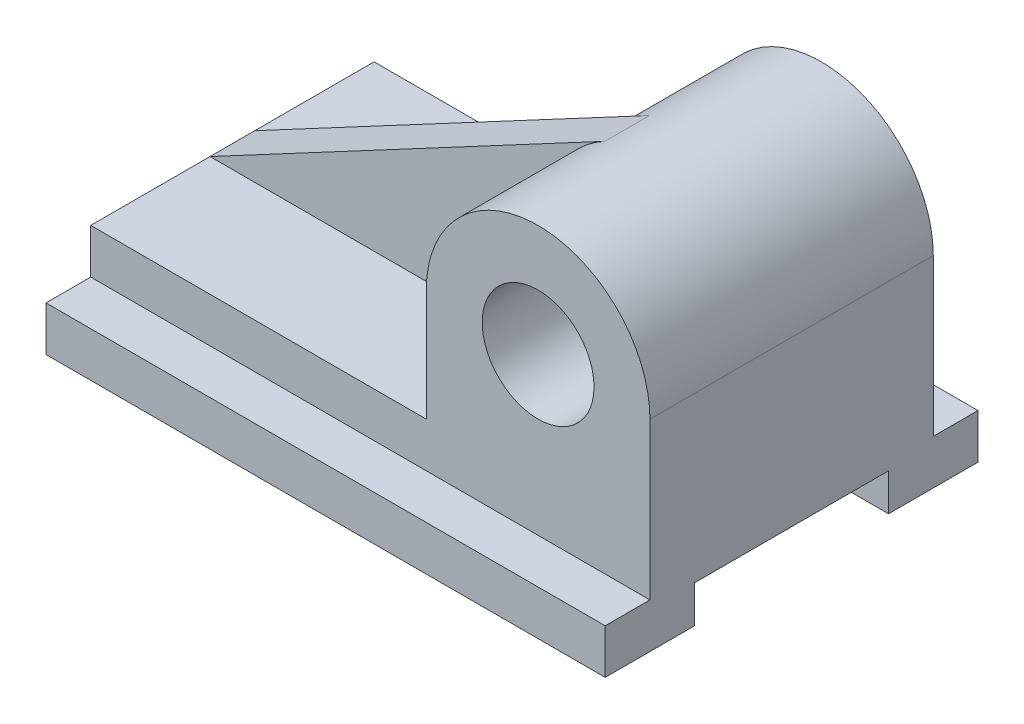
ISO-10303-21;
HEADER;
FILE_DESCRIPTION(('STEP AP214'),'2;1');
FILE_NAME('part.step','',(''),(''),'','','');
FILE_SCHEMA(('AUTOMOTIVE_DESIGN { 1 0 10303 214 1 1 1 1 }'));
ENDSEC;
DATA;
#1=APPLICATION_CONTEXT('core data for automotive mechanical design processes');
#2=APPLICATION_PROTOCOL_DEFINITION('international standard','automotive_design',2000,#1);
#3=PRODUCT_CONTEXT('',#1,'mechanical');
#4=PRODUCT('Part','Part','',(#3));
#5=PRODUCT_RELATED_PRODUCT_CATEGORY('part','',(#4));
#6=PRODUCT_DEFINITION_FORMATION('','',#4);
#7=PRODUCT_DEFINITION_CONTEXT('part definition',#1,'design');
#8=PRODUCT_DEFINITION('design','',#6,#7);
#9=PRODUCT_DEFINITION_SHAPE('','',#8);
#10=(LENGTH_UNIT() NAMED_UNIT(*) SI_UNIT(.MILLI.,.METRE.));
#11=(NAMED_UNIT(*) PLANE_ANGLE_UNIT() SI_UNIT($,.RADIAN.));
#12=(NAMED_UNIT(*) SI_UNIT($,.STERADIAN.) SOLID_ANGLE_UNIT());
#13=UNCERTAINTY_MEASURE_WITH_UNIT(LENGTH_MEASURE(1.E-05),#10,'distance_accuracy_value','');
#14=(GEOMETRIC_REPRESENTATION_CONTEXT(3) GLOBAL_UNCERTAINTY_ASSIGNED_CONTEXT((#13)) GLOBAL_UNIT_ASSIGNED_CONTEXT((#10,
#11,#12)) REPRESENTATION_CONTEXT('',''));
#15=CARTESIAN_POINT('',(0.,0.,0.));
#16=DIRECTION('',(0.,0.,1.));
#17=DIRECTION('',(1.,0.,0.));
#18=AXIS2_PLACEMENT_3D('',#15,#16,#17);
#19=CARTESIAN_POINT('',(0.,0.,76.));
#20=DIRECTION('',(0.,0.,-1.));
#21=DIRECTION('',(-1.,0.,0.));
#22=AXIS2_PLACEMENT_3D('',#19,#20,#21);
#23=CYLINDRICAL_SURFACE('',#22,30.);
#24=DIRECTION('',(0.,0.,-1.));
#25=VECTOR('',#24,1.);
#26=CARTESIAN_POINT('',(-14.1176470588235,26.4705882352941,44.));
#27=LINE('',#26,#25);
#28=CARTESIAN_POINT('',(-14.1176470588235,26.4705882352941,44.));
#29=VERTEX_POINT('',#28);
#30=CARTESIAN_POINT('',(-14.1176470588235,26.4705882352941,32.));
#31=VERTEX_POINT('',#30);
#32=EDGE_CURVE('E60',#29,#31,#27,.T.);
#33=ORIENTED_EDGE('',*,*,#32,.F.);
#34=CARTESIAN_POINT('',(0.,0.,44.));
#35=DIRECTION('',(0.,0.,1.));
#36=DIRECTION('',(1.,0.,0.));
#37=AXIS2_PLACEMENT_3D('',#34,#35,#36);
#38=CIRCLE('',#37,30.);
#39=CARTESIAN_POINT('',(-30.,0.,44.));
#40=VERTEX_POINT('',#39);
#41=EDGE_CURVE('E356',#29,#40,#38,.T.);
#42=ORIENTED_EDGE('',*,*,#41,.T.);
#43=DIRECTION('',(0.,0.,-1.));
#44=VECTOR('',#43,1.);
#45=CARTESIAN_POINT('',(-30.,0.,76.));
#46=LINE('',#45,#44);
#47=CARTESIAN_POINT('',(-30.,0.,76.));
#48=VERTEX_POINT('',#47);
#49=EDGE_CURVE('E44',#48,#40,#46,.T.);
#50=ORIENTED_EDGE('',*,*,#49,.F.);
#51=CARTESIAN_POINT('',(0.,0.,76.));
#52=DIRECTION('',(0.,0.,1.));
#53=DIRECTION('',(1.,0.,0.));
#54=AXIS2_PLACEMENT_3D('',#51,#52,#53);
#55=CIRCLE('',#54,30.);
#56=CARTESIAN_POINT('',(30.,0.,76.));
#57=VERTEX_POINT('',#56);
#58=EDGE_CURVE('E268',#57,#48,#55,.T.);
#59=ORIENTED_EDGE('',*,*,#58,.F.);
#60=DIRECTION('',(0.,0.,-1.));
#61=VECTOR('',#60,1.);
#62=CARTESIAN_POINT('',(30.,0.,76.));
#63=LINE('',#62,#61);
#64=CARTESIAN_POINT('',(30.,0.,0.));
#65=VERTEX_POINT('',#64);
#66=EDGE_CURVE('E11',#57,#65,#63,.T.);
#67=ORIENTED_EDGE('',*,*,#66,.T.);
#68=CARTESIAN_POINT('',(0.,0.,0.));
#69=DIRECTION('',(0.,0.,1.));
#70=DIRECTION('',(1.,0.,0.));
#71=AXIS2_PLACEMENT_3D('',#68,#69,#70);
#72=CIRCLE('',#71,30.);
#73=CARTESIAN_POINT('',(-30.,0.,0.));
#74=VERTEX_POINT('',#73);
#75=EDGE_CURVE('E289',#65,#74,#72,.T.);
#76=ORIENTED_EDGE('',*,*,#75,.T.);
#77=DIRECTION('',(0.,0.,-1.));
#78=VECTOR('',#77,1.);
#79=CARTESIAN_POINT('',(-30.,0.,32.));
#80=LINE('',#79,#78);
#81=CARTESIAN_POINT('',(-30.,0.,32.));
#82=VERTEX_POINT('',#81);
#83=EDGE_CURVE('E170',#82,#74,#80,.T.);
#84=ORIENTED_EDGE('',*,*,#83,.F.);
#85=CARTESIAN_POINT('',(0.,0.,32.));
#86=DIRECTION('',(0.,0.,1.));
#87=DIRECTION('',(1.,0.,0.));
#88=AXIS2_PLACEMENT_3D('',#85,#86,#87);
#89=CIRCLE('',#88,30.);
#90=EDGE_CURVE('E163',#31,#82,#89,.T.);
#91=ORIENTED_EDGE('',*,*,#90,.F.);
#92=EDGE_LOOP('',(#33,#42,#50,#59,#67,#76,#84,#91));
#93=FACE_BOUND('',#92,.T.);
#94=ADVANCED_FACE('F35',(#93),#23,.T.);
#95=CARTESIAN_POINT('',(30.,0.,76.));
#96=DIRECTION('',(1.,0.,0.));
#97=DIRECTION('',(0.,1.,0.));
#98=AXIS2_PLACEMENT_3D('',#95,#96,#97);
#99=PLANE('',#98);
#100=DIRECTION('',(0.,0.,-1.));
#101=VECTOR('',#100,1.);
#102=CARTESIAN_POINT('',(30.,-54.,76.));
#103=LINE('',#102,#101);
#104=CARTESIAN_POINT('',(30.,-54.,88.));
#105=VERTEX_POINT('',#104);
#106=CARTESIAN_POINT('',(30.,-54.,64.));
#107=VERTEX_POINT('',#106);
#108=EDGE_CURVE('E284',#105,#107,#103,.T.);
#109=ORIENTED_EDGE('',*,*,#108,.T.);
#110=DIRECTION('',(0.,-1.,0.));
#111=VECTOR('',#110,1.);
#112=CARTESIAN_POINT('',(30.,-44.,64.));
#113=LINE('',#112,#111);
#114=CARTESIAN_POINT('',(30.,-44.,64.));
#115=VERTEX_POINT('',#114);
#116=EDGE_CURVE('E200',#115,#107,#113,.T.);
#117=ORIENTED_EDGE('',*,*,#116,.F.);
#118=DIRECTION('',(0.,0.,1.));
#119=VECTOR('',#118,1.);
#120=CARTESIAN_POINT('',(30.,-44.,0.));
#121=LINE('',#120,#119);
#122=CARTESIAN_POINT('',(30.,-44.,12.));
#123=VERTEX_POINT('',#122);
#124=EDGE_CURVE('E195',#123,#115,#121,.T.);
#125=ORIENTED_EDGE('',*,*,#124,.F.);
#126=DIRECTION('',(0.,-1.,0.));
#127=VECTOR('',#126,1.);
#128=CARTESIAN_POINT('',(30.,-44.,12.));
#129=LINE('',#128,#127);
#130=CARTESIAN_POINT('',(30.,-54.,12.));
#131=VERTEX_POINT('',#130);
#132=EDGE_CURVE('E203',#123,#131,#129,.T.);
#133=ORIENTED_EDGE('',*,*,#132,.T.);
#134=CARTESIAN_POINT('',(30.,-54.,-12.));
#135=VERTEX_POINT('',#134);
#136=EDGE_CURVE('E286',#131,#135,#103,.T.);
#137=ORIENTED_EDGE('',*,*,#136,.T.);
#138=DIRECTION('',(0.,-1.,0.));
#139=VECTOR('',#138,1.);
#140=CARTESIAN_POINT('',(30.,-54.,-12.));
#141=LINE('',#140,#139);
#142=CARTESIAN_POINT('',(30.,-42.,-12.));
#143=VERTEX_POINT('',#142);
#144=EDGE_CURVE('E210',#143,#135,#141,.T.);
#145=ORIENTED_EDGE('',*,*,#144,.F.);
#146=DIRECTION('',(0.,0.,1.));
#147=VECTOR('',#146,1.);
#148=CARTESIAN_POINT('',(30.,-42.,-12.));
#149=LINE('',#148,#147);
#150=CARTESIAN_POINT('',(30.,-42.,0.));
#151=VERTEX_POINT('',#150);
#152=EDGE_CURVE('E220',#143,#151,#149,.T.);
#153=ORIENTED_EDGE('',*,*,#152,.T.);
#154=DIRECTION('',(0.,-1.,0.));
#155=VECTOR('',#154,1.);
#156=CARTESIAN_POINT('',(30.,0.,0.));
#157=LINE('',#156,#155);
#158=EDGE_CURVE('E291',#65,#151,#157,.T.);
#159=ORIENTED_EDGE('',*,*,#158,.F.);
#160=ORIENTED_EDGE('',*,*,#66,.F.);
#161=DIRECTION('',(0.,-1.,0.));
#162=VECTOR('',#161,1.);
#163=CARTESIAN_POINT('',(30.,0.,76.));
#164=LINE('',#163,#162);
#165=CARTESIAN_POINT('',(30.,-42.,76.));
#166=VERTEX_POINT('',#165);
#167=EDGE_CURVE('E265',#57,#166,#164,.T.);
#168=ORIENTED_EDGE('',*,*,#167,.T.);
#169=DIRECTION('',(0.,0.,-1.));
#170=VECTOR('',#169,1.);
#171=CARTESIAN_POINT('',(30.,-42.,88.));
#172=LINE('',#171,#170);
#173=CARTESIAN_POINT('',(30.,-42.,88.));
#174=VERTEX_POINT('',#173);
#175=EDGE_CURVE('E298',#174,#166,#172,.T.);
#176=ORIENTED_EDGE('',*,*,#175,.F.);
#177=DIRECTION('',(0.,1.,0.));
#178=VECTOR('',#177,1.);
#179=CARTESIAN_POINT('',(30.,-54.,88.));
#180=LINE('',#179,#178);
#181=EDGE_CURVE('E305',#105,#174,#180,.T.);
#182=ORIENTED_EDGE('',*,*,#181,.F.);
#183=EDGE_LOOP('',(#109,#117,#125,#133,#137,#145,#153,#159,#160,#168,#176,#182));
#184=FACE_BOUND('',#183,.T.);
#185=ADVANCED_FACE('F313',(#184),#99,.T.);
#186=CARTESIAN_POINT('',(-120.,0.,76.));
#187=DIRECTION('',(-1.,0.,0.));
#188=DIRECTION('',(0.,0.,1.));
#189=AXIS2_PLACEMENT_3D('',#186,#187,#188);
#190=PLANE('',#189);
#191=DIRECTION('',(0.,0.,-1.));
#192=VECTOR('',#191,1.);
#193=CARTESIAN_POINT('',(-120.,-44.,0.));
#194=LINE('',#193,#192);
#195=CARTESIAN_POINT('',(-120.,-44.,64.));
#196=VERTEX_POINT('',#195);
#197=CARTESIAN_POINT('',(-120.,-44.,12.));
#198=VERTEX_POINT('',#197);
#199=EDGE_CURVE('E189',#196,#198,#194,.T.);
#200=ORIENTED_EDGE('',*,*,#199,.F.);
#201=DIRECTION('',(0.,-1.,0.));
#202=VECTOR('',#201,1.);
#203=CARTESIAN_POINT('',(-120.,-44.,64.));
#204=LINE('',#203,#202);
#205=CARTESIAN_POINT('',(-120.,-54.,64.));
#206=VERTEX_POINT('',#205);
#207=EDGE_CURVE('E197',#196,#206,#204,.T.);
#208=ORIENTED_EDGE('',*,*,#207,.T.);
#209=DIRECTION('',(0.,0.,-1.));
#210=VECTOR('',#209,1.);
#211=CARTESIAN_POINT('',(-120.,-54.,76.));
#212=LINE('',#211,#210);
#213=CARTESIAN_POINT('',(-120.,-54.,88.));
#214=VERTEX_POINT('',#213);
#215=EDGE_CURVE('E280',#214,#206,#212,.T.);
#216=ORIENTED_EDGE('',*,*,#215,.F.);
#217=DIRECTION('',(0.,-1.,0.));
#218=VECTOR('',#217,1.);
#219=CARTESIAN_POINT('',(-120.,-54.,88.));
#220=LINE('',#219,#218);
#221=CARTESIAN_POINT('',(-120.,-42.,88.));
#222=VERTEX_POINT('',#221);
#223=EDGE_CURVE('E223',#222,#214,#220,.T.);
#224=ORIENTED_EDGE('',*,*,#223,.F.);
#225=DIRECTION('',(0.,0.,-1.));
#226=VECTOR('',#225,1.);
#227=CARTESIAN_POINT('',(-120.,-42.,88.));
#228=LINE('',#227,#226);
#229=CARTESIAN_POINT('',(-120.,-42.,76.));
#230=VERTEX_POINT('',#229);
#231=EDGE_CURVE('E255',#222,#230,#228,.T.);
#232=ORIENTED_EDGE('',*,*,#231,.T.);
#233=DIRECTION('',(0.,1.,0.));
#234=VECTOR('',#233,1.);
#235=CARTESIAN_POINT('',(-120.,0.,76.));
#236=LINE('',#235,#234);
#237=CARTESIAN_POINT('',(-120.,-30.,76.));
#238=VERTEX_POINT('',#237);
#239=EDGE_CURVE('E252',#230,#238,#236,.T.);
#240=ORIENTED_EDGE('',*,*,#239,.T.);
#241=DIRECTION('',(0.,0.,-1.));
#242=VECTOR('',#241,1.);
#243=CARTESIAN_POINT('',(-120.,-30.,76.));
#244=LINE('',#243,#242);
#245=CARTESIAN_POINT('',(-120.,-30.,44.));
#246=VERTEX_POINT('',#245);
#247=EDGE_CURVE('E277',#238,#246,#244,.T.);
#248=ORIENTED_EDGE('',*,*,#247,.T.);
#249=DIRECTION('',(0.,0.,-1.));
#250=VECTOR('',#249,1.);
#251=CARTESIAN_POINT('',(-120.,-30.,44.));
#252=LINE('',#251,#250);
#253=CARTESIAN_POINT('',(-120.,-30.,32.));
#254=VERTEX_POINT('',#253);
#255=EDGE_CURVE('E178',#246,#254,#252,.T.);
#256=ORIENTED_EDGE('',*,*,#255,.T.);
#257=DIRECTION('',(0.,0.,-1.));
#258=VECTOR('',#257,1.);
#259=CARTESIAN_POINT('',(-120.,-30.,32.));
#260=LINE('',#259,#258);
#261=CARTESIAN_POINT('',(-120.,-30.,0.));
#262=VERTEX_POINT('',#261);
#263=EDGE_CURVE('E368',#254,#262,#260,.T.);
#264=ORIENTED_EDGE('',*,*,#263,.T.);
#265=DIRECTION('',(0.,1.,0.));
#266=VECTOR('',#265,1.);
#267=CARTESIAN_POINT('',(-120.,0.,0.));
#268=LINE('',#267,#266);
#269=CARTESIAN_POINT('',(-120.,-42.,0.));
#270=VERTEX_POINT('',#269);
#271=EDGE_CURVE('E229',#270,#262,#268,.T.);
#272=ORIENTED_EDGE('',*,*,#271,.F.);
#273=DIRECTION('',(0.,0.,1.));
#274=VECTOR('',#273,1.);
#275=CARTESIAN_POINT('',(-120.,-42.,-12.));
#276=LINE('',#275,#274);
#277=CARTESIAN_POINT('',(-120.,-42.,-12.));
#278=VERTEX_POINT('',#277);
#279=EDGE_CURVE('E234',#278,#270,#276,.T.);
#280=ORIENTED_EDGE('',*,*,#279,.F.);
#281=DIRECTION('',(0.,1.,0.));
#282=VECTOR('',#281,1.);
#283=CARTESIAN_POINT('',(-120.,-54.,-12.));
#284=LINE('',#283,#282);
#285=CARTESIAN_POINT('',(-120.,-54.,-12.));
#286=VERTEX_POINT('',#285);
#287=EDGE_CURVE('E216',#286,#278,#284,.T.);
#288=ORIENTED_EDGE('',*,*,#287,.F.);
#289=CARTESIAN_POINT('',(-120.,-54.,12.));
#290=VERTEX_POINT('',#289);
#291=EDGE_CURVE('E283',#290,#286,#212,.T.);
#292=ORIENTED_EDGE('',*,*,#291,.F.);
#293=DIRECTION('',(0.,-1.,0.));
#294=VECTOR('',#293,1.);
#295=CARTESIAN_POINT('',(-120.,-44.,12.));
#296=LINE('',#295,#294);
#297=EDGE_CURVE('E206',#198,#290,#296,.T.);
#298=ORIENTED_EDGE('',*,*,#297,.F.);
#299=EDGE_LOOP('',(#200,#208,#216,#224,#232,#240,#248,#256,#264,#272,#280,#288,#292,#298));
#300=FACE_BOUND('',#299,.T.);
#301=ADVANCED_FACE('F318',(#300),#190,.T.);
#302=CARTESIAN_POINT('',(0.,-54.,76.));
#303=DIRECTION('',(0.,1.,0.));
#304=DIRECTION('',(0.,0.,1.));
#305=AXIS2_PLACEMENT_3D('',#302,#303,#304);
#306=PLANE('',#305);
#307=DIRECTION('',(1.,0.,0.));
#308=VECTOR('',#307,1.);
#309=CARTESIAN_POINT('',(0.,-54.,64.));
#310=LINE('',#309,#308);
#311=EDGE_CURVE('E177',#206,#107,#310,.T.);
#312=ORIENTED_EDGE('',*,*,#311,.T.);
#313=ORIENTED_EDGE('',*,*,#108,.F.);
#314=DIRECTION('',(1.,0.,0.));
#315=VECTOR('',#314,1.);
#316=CARTESIAN_POINT('',(-120.,-54.,88.));
#317=LINE('',#316,#315);
#318=EDGE_CURVE('E248',#214,#105,#317,.T.);
#319=ORIENTED_EDGE('',*,*,#318,.F.);
#320=ORIENTED_EDGE('',*,*,#215,.T.);
#321=EDGE_LOOP('',(#312,#313,#319,#320));
#322=FACE_BOUND('',#321,.T.);
#323=ADVANCED_FACE('F319',(#322),#306,.F.);
#324=CARTESIAN_POINT('',(0.,0.,0.));
#325=DIRECTION('',(0.,0.,1.));
#326=DIRECTION('',(1.,0.,0.));
#327=AXIS2_PLACEMENT_3D('',#324,#325,#326);
#328=PLANE('',#327);
#329=DIRECTION('',(0.,-1.,0.));
#330=VECTOR('',#329,1.);
#331=CARTESIAN_POINT('',(-30.,-1.04083408558608E-13,0.));
#332=LINE('',#331,#330);
#333=CARTESIAN_POINT('',(-29.9999999999999,-30.,0.));
#334=VERTEX_POINT('',#333);
#335=EDGE_CURVE('E171',#74,#334,#332,.T.);
#336=ORIENTED_EDGE('',*,*,#335,.F.);
#337=ORIENTED_EDGE('',*,*,#75,.F.);
#338=ORIENTED_EDGE('',*,*,#158,.T.);
#339=DIRECTION('',(1.,0.,0.));
#340=VECTOR('',#339,1.);
#341=CARTESIAN_POINT('',(30.,-42.,0.));
#342=LINE('',#341,#340);
#343=EDGE_CURVE('E202',#270,#151,#342,.T.);
#344=ORIENTED_EDGE('',*,*,#343,.F.);
#345=ORIENTED_EDGE('',*,*,#271,.T.);
#346=DIRECTION('',(1.,0.,0.));
#347=VECTOR('',#346,1.);
#348=CARTESIAN_POINT('',(0.,-30.,0.));
#349=LINE('',#348,#347);
#350=EDGE_CURVE('E377',#262,#334,#349,.T.);
#351=ORIENTED_EDGE('',*,*,#350,.T.);
#352=EDGE_LOOP('',(#336,#337,#338,#344,#345,#351));
#353=FACE_BOUND('',#352,.T.);
#354=CARTESIAN_POINT('',(0.,0.,0.));
#355=DIRECTION('',(0.,0.,1.));
#356=DIRECTION('',(1.,0.,0.));
#357=AXIS2_PLACEMENT_3D('',#354,#355,#356);
#358=CIRCLE('',#357,15.);
#359=CARTESIAN_POINT('',(15.,0.,0.));
#360=VERTEX_POINT('',#359);
#361=EDGE_CURVE('E294',#360,#360,#358,.T.);
#362=ORIENTED_EDGE('',*,*,#361,.T.);
#363=EDGE_LOOP('',(#362));
#364=FACE_BOUND('',#363,.T.);
#365=ADVANCED_FACE('F390',(#353,#364),#328,.F.);
#366=CARTESIAN_POINT('',(-30.,0.,76.));
#367=DIRECTION('',(1.,0.,0.));
#368=DIRECTION('',(0.,1.,0.));
#369=AXIS2_PLACEMENT_3D('',#366,#367,#368);
#370=PLANE('',#369);
#371=ORIENTED_EDGE('',*,*,#49,.T.);
#372=DIRECTION('',(0.,-1.,0.));
#373=VECTOR('',#372,1.);
#374=CARTESIAN_POINT('',(-30.,0.,44.));
#375=LINE('',#374,#373);
#376=CARTESIAN_POINT('',(-30.,-30.,44.));
#377=VERTEX_POINT('',#376);
#378=EDGE_CURVE('E183',#40,#377,#375,.T.);
#379=ORIENTED_EDGE('',*,*,#378,.T.);
#380=DIRECTION('',(0.,0.,-1.));
#381=VECTOR('',#380,1.);
#382=CARTESIAN_POINT('',(-30.,-30.,76.));
#383=LINE('',#382,#381);
#384=CARTESIAN_POINT('',(-30.,-30.,76.));
#385=VERTEX_POINT('',#384);
#386=EDGE_CURVE('E274',#385,#377,#383,.T.);
#387=ORIENTED_EDGE('',*,*,#386,.F.);
#388=DIRECTION('',(0.,-1.,0.));
#389=VECTOR('',#388,1.);
#390=CARTESIAN_POINT('',(-30.,0.,76.));
#391=LINE('',#390,#389);
#392=EDGE_CURVE('E344',#48,#385,#391,.T.);
#393=ORIENTED_EDGE('',*,*,#392,.F.);
#394=EDGE_LOOP('',(#371,#379,#387,#393));
#395=FACE_BOUND('',#394,.T.);
#396=ADVANCED_FACE('F359',(#395),#370,.F.);
#397=CARTESIAN_POINT('',(0.,-30.,76.));
#398=DIRECTION('',(0.,-1.,0.));
#399=DIRECTION('',(1.,0.,0.));
#400=AXIS2_PLACEMENT_3D('',#397,#398,#399);
#401=PLANE('',#400);
#402=ORIENTED_EDGE('',*,*,#386,.T.);
#403=DIRECTION('',(-1.,0.,0.));
#404=VECTOR('',#403,1.);
#405=CARTESIAN_POINT('',(0.,-30.,44.));
#406=LINE('',#405,#404);
#407=EDGE_CURVE('E363',#377,#246,#406,.T.);
#408=ORIENTED_EDGE('',*,*,#407,.T.);
#409=ORIENTED_EDGE('',*,*,#247,.F.);
#410=DIRECTION('',(-1.,0.,0.));
#411=VECTOR('',#410,1.);
#412=CARTESIAN_POINT('',(0.,-30.,76.));
#413=LINE('',#412,#411);
#414=EDGE_CURVE('E342',#385,#238,#413,.T.);
#415=ORIENTED_EDGE('',*,*,#414,.F.);
#416=EDGE_LOOP('',(#402,#408,#409,#415));
#417=FACE_BOUND('',#416,.T.);
#418=ADVANCED_FACE('F393',(#417),#401,.F.);
#419=CARTESIAN_POINT('',(0.,0.,76.));
#420=DIRECTION('',(0.,0.,-1.));
#421=DIRECTION('',(-1.,0.,0.));
#422=AXIS2_PLACEMENT_3D('',#419,#420,#421);
#423=CYLINDRICAL_SURFACE('',#422,15.);
#424=CARTESIAN_POINT('',(0.,0.,76.));
#425=DIRECTION('',(0.,0.,1.));
#426=DIRECTION('',(1.,0.,0.));
#427=AXIS2_PLACEMENT_3D('',#424,#425,#426);
#428=CIRCLE('',#427,15.);
#429=CARTESIAN_POINT('',(15.,0.,76.));
#430=VERTEX_POINT('',#429);
#431=EDGE_CURVE('E262',#430,#430,#428,.T.);
#432=ORIENTED_EDGE('',*,*,#431,.T.);
#433=EDGE_LOOP('',(#432));
#434=FACE_BOUND('',#433,.T.);
#435=ORIENTED_EDGE('',*,*,#361,.F.);
#436=EDGE_LOOP('',(#435));
#437=FACE_BOUND('',#436,.T.);
#438=ADVANCED_FACE('F37',(#434,#437),#423,.F.);
#439=ORIENTED_EDGE('',*,*,#136,.F.);
#440=DIRECTION('',(1.,0.,0.));
#441=VECTOR('',#440,1.);
#442=CARTESIAN_POINT('',(0.,-54.,12.));
#443=LINE('',#442,#441);
#444=EDGE_CURVE('E181',#290,#131,#443,.T.);
#445=ORIENTED_EDGE('',*,*,#444,.F.);
#446=ORIENTED_EDGE('',*,*,#291,.T.);
#447=DIRECTION('',(-1.,0.,0.));
#448=VECTOR('',#447,1.);
#449=CARTESIAN_POINT('',(30.,-54.,-12.));
#450=LINE('',#449,#448);
#451=EDGE_CURVE('E213',#135,#286,#450,.T.);
#452=ORIENTED_EDGE('',*,*,#451,.F.);
#453=EDGE_LOOP('',(#439,#445,#446,#452));
#454=FACE_BOUND('',#453,.T.);
#455=ADVANCED_FACE('F333',(#454),#306,.F.);
#456=CARTESIAN_POINT('',(0.,0.,76.));
#457=DIRECTION('',(0.,0.,1.));
#458=DIRECTION('',(1.,0.,0.));
#459=AXIS2_PLACEMENT_3D('',#456,#457,#458);
#460=PLANE('',#459);
#461=DIRECTION('',(-1.,0.,0.));
#462=VECTOR('',#461,1.);
#463=CARTESIAN_POINT('',(-120.,-42.,76.));
#464=LINE('',#463,#462);
#465=EDGE_CURVE('E237',#166,#230,#464,.T.);
#466=ORIENTED_EDGE('',*,*,#465,.F.);
#467=ORIENTED_EDGE('',*,*,#167,.F.);
#468=ORIENTED_EDGE('',*,*,#58,.T.);
#469=ORIENTED_EDGE('',*,*,#392,.T.);
#470=ORIENTED_EDGE('',*,*,#414,.T.);
#471=ORIENTED_EDGE('',*,*,#239,.F.);
#472=EDGE_LOOP('',(#466,#467,#468,#469,#470,#471));
#473=FACE_BOUND('',#472,.T.);
#474=ORIENTED_EDGE('',*,*,#431,.F.);
#475=EDGE_LOOP('',(#474));
#476=FACE_BOUND('',#475,.T.);
#477=ADVANCED_FACE('F354',(#473,#476),#460,.T.);
#478=CARTESIAN_POINT('',(-120.,-42.,88.));
#479=DIRECTION('',(0.,-1.,0.));
#480=DIRECTION('',(0.,0.,-1.));
#481=AXIS2_PLACEMENT_3D('',#478,#479,#480);
#482=PLANE('',#481);
#483=ORIENTED_EDGE('',*,*,#465,.T.);
#484=ORIENTED_EDGE('',*,*,#231,.F.);
#485=DIRECTION('',(-1.,0.,0.));
#486=VECTOR('',#485,1.);
#487=CARTESIAN_POINT('',(-120.,-42.,88.));
#488=LINE('',#487,#486);
#489=EDGE_CURVE('E260',#174,#222,#488,.T.);
#490=ORIENTED_EDGE('',*,*,#489,.F.);
#491=ORIENTED_EDGE('',*,*,#175,.T.);
#492=EDGE_LOOP('',(#483,#484,#490,#491));
#493=FACE_BOUND('',#492,.T.);
#494=ADVANCED_FACE('F316',(#493),#482,.F.);
#495=CARTESIAN_POINT('',(0.,0.,88.));
#496=DIRECTION('',(0.,0.,-1.));
#497=DIRECTION('',(-1.,0.,0.));
#498=AXIS2_PLACEMENT_3D('',#495,#496,#497);
#499=PLANE('',#498);
#500=ORIENTED_EDGE('',*,*,#223,.T.);
#501=ORIENTED_EDGE('',*,*,#318,.T.);
#502=ORIENTED_EDGE('',*,*,#181,.T.);
#503=ORIENTED_EDGE('',*,*,#489,.T.);
#504=EDGE_LOOP('',(#500,#501,#502,#503));
#505=FACE_BOUND('',#504,.T.);
#506=ADVANCED_FACE('F310',(#505),#499,.F.);
#507=CARTESIAN_POINT('',(30.,-42.,-12.));
#508=DIRECTION('',(0.,-1.,0.));
#509=DIRECTION('',(0.,0.,-1.));
#510=AXIS2_PLACEMENT_3D('',#507,#508,#509);
#511=PLANE('',#510);
#512=ORIENTED_EDGE('',*,*,#343,.T.);
#513=ORIENTED_EDGE('',*,*,#152,.F.);
#514=DIRECTION('',(1.,0.,0.));
#515=VECTOR('',#514,1.);
#516=CARTESIAN_POINT('',(30.,-42.,-12.));
#517=LINE('',#516,#515);
#518=EDGE_CURVE('E218',#278,#143,#517,.T.);
#519=ORIENTED_EDGE('',*,*,#518,.F.);
#520=ORIENTED_EDGE('',*,*,#279,.T.);
#521=EDGE_LOOP('',(#512,#513,#519,#520));
#522=FACE_BOUND('',#521,.T.);
#523=ADVANCED_FACE('F425',(#522),#511,.F.);
#524=CARTESIAN_POINT('',(0.,0.,-12.));
#525=DIRECTION('',(0.,0.,1.));
#526=DIRECTION('',(1.,0.,0.));
#527=AXIS2_PLACEMENT_3D('',#524,#525,#526);
#528=PLANE('',#527);
#529=ORIENTED_EDGE('',*,*,#144,.T.);
#530=ORIENTED_EDGE('',*,*,#451,.T.);
#531=ORIENTED_EDGE('',*,*,#287,.T.);
#532=ORIENTED_EDGE('',*,*,#518,.T.);
#533=EDGE_LOOP('',(#529,#530,#531,#532));
#534=FACE_BOUND('',#533,.T.);
#535=ADVANCED_FACE('F338',(#534),#528,.F.);
#536=CARTESIAN_POINT('',(0.,-44.,64.));
#537=DIRECTION('',(0.,0.,-1.));
#538=DIRECTION('',(-1.,0.,0.));
#539=AXIS2_PLACEMENT_3D('',#536,#537,#538);
#540=PLANE('',#539);
#541=ORIENTED_EDGE('',*,*,#311,.F.);
#542=ORIENTED_EDGE('',*,*,#207,.F.);
#543=DIRECTION('',(1.,0.,0.));
#544=VECTOR('',#543,1.);
#545=CARTESIAN_POINT('',(0.,-44.,64.));
#546=LINE('',#545,#544);
#547=EDGE_CURVE('E187',#196,#115,#546,.T.);
#548=ORIENTED_EDGE('',*,*,#547,.T.);
#549=ORIENTED_EDGE('',*,*,#116,.T.);
#550=EDGE_LOOP('',(#541,#542,#548,#549));
#551=FACE_BOUND('',#550,.T.);
#552=ADVANCED_FACE('F321',(#551),#540,.T.);
#553=CARTESIAN_POINT('',(0.,-44.,12.));
#554=DIRECTION('',(0.,0.,-1.));
#555=DIRECTION('',(-1.,0.,0.));
#556=AXIS2_PLACEMENT_3D('',#553,#554,#555);
#557=PLANE('',#556);
#558=ORIENTED_EDGE('',*,*,#444,.T.);
#559=ORIENTED_EDGE('',*,*,#132,.F.);
#560=DIRECTION('',(1.,0.,0.));
#561=VECTOR('',#560,1.);
#562=CARTESIAN_POINT('',(0.,-44.,12.));
#563=LINE('',#562,#561);
#564=EDGE_CURVE('E192',#198,#123,#563,.T.);
#565=ORIENTED_EDGE('',*,*,#564,.F.);
#566=ORIENTED_EDGE('',*,*,#297,.T.);
#567=EDGE_LOOP('',(#558,#559,#565,#566));
#568=FACE_BOUND('',#567,.T.);
#569=ADVANCED_FACE('F329',(#568),#557,.F.);
#570=CARTESIAN_POINT('',(0.,-44.,0.));
#571=DIRECTION('',(0.,-1.,0.));
#572=DIRECTION('',(0.,0.,-1.));
#573=AXIS2_PLACEMENT_3D('',#570,#571,#572);
#574=PLANE('',#573);
#575=ORIENTED_EDGE('',*,*,#547,.F.);
#576=ORIENTED_EDGE('',*,*,#199,.T.);
#577=ORIENTED_EDGE('',*,*,#564,.T.);
#578=ORIENTED_EDGE('',*,*,#124,.T.);
#579=EDGE_LOOP('',(#575,#576,#577,#578));
#580=FACE_BOUND('',#579,.T.);
#581=ADVANCED_FACE('F326',(#580),#574,.T.);
#582=CARTESIAN_POINT('',(-14.1176470588235,26.4705882352941,44.));
#583=DIRECTION('',(-0.470588235294118,0.882352941176471,0.));
#584=DIRECTION('',(-0.882352941176471,-0.470588235294118,0.));
#585=AXIS2_PLACEMENT_3D('',#582,#583,#584);
#586=PLANE('',#585);
#587=DIRECTION('',(-0.882352941176471,-0.470588235294118,0.));
#588=VECTOR('',#587,1.);
#589=CARTESIAN_POINT('',(-14.1176470588235,26.4705882352941,32.));
#590=LINE('',#589,#588);
#591=EDGE_CURVE('E161',#31,#254,#590,.T.);
#592=ORIENTED_EDGE('',*,*,#591,.T.);
#593=ORIENTED_EDGE('',*,*,#255,.F.);
#594=DIRECTION('',(0.882352941176471,0.470588235294118,0.));
#595=VECTOR('',#594,1.);
#596=CARTESIAN_POINT('',(-14.1176470588235,26.4705882352941,44.));
#597=LINE('',#596,#595);
#598=EDGE_CURVE('E176',#246,#29,#597,.T.);
#599=ORIENTED_EDGE('',*,*,#598,.T.);
#600=ORIENTED_EDGE('',*,*,#32,.T.);
#601=EDGE_LOOP('',(#592,#593,#599,#600));
#602=FACE_BOUND('',#601,.T.);
#603=ADVANCED_FACE('F174',(#602),#586,.T.);
#604=CARTESIAN_POINT('',(0.,0.,44.));
#605=DIRECTION('',(0.,0.,1.));
#606=DIRECTION('',(1.,0.,0.));
#607=AXIS2_PLACEMENT_3D('',#604,#605,#606);
#608=PLANE('',#607);
#609=ORIENTED_EDGE('',*,*,#41,.F.);
#610=ORIENTED_EDGE('',*,*,#598,.F.);
#611=ORIENTED_EDGE('',*,*,#407,.F.);
#612=ORIENTED_EDGE('',*,*,#378,.F.);
#613=EDGE_LOOP('',(#609,#610,#611,#612));
#614=FACE_BOUND('',#613,.T.);
#615=ADVANCED_FACE('F362',(#614),#608,.T.);
#616=CARTESIAN_POINT('',(0.,-30.,32.));
#617=DIRECTION('',(0.,1.,0.));
#618=DIRECTION('',(-1.,0.,0.));
#619=AXIS2_PLACEMENT_3D('',#616,#617,#618);
#620=PLANE('',#619);
#621=ORIENTED_EDGE('',*,*,#350,.F.);
#622=ORIENTED_EDGE('',*,*,#263,.F.);
#623=DIRECTION('',(1.,0.,0.));
#624=VECTOR('',#623,1.);
#625=CARTESIAN_POINT('',(0.,-30.,32.));
#626=LINE('',#625,#624);
#627=CARTESIAN_POINT('',(-29.9999999999999,-30.,32.));
#628=VERTEX_POINT('',#627);
#629=EDGE_CURVE('E52',#254,#628,#626,.T.);
#630=ORIENTED_EDGE('',*,*,#629,.T.);
#631=DIRECTION('',(0.,0.,-1.));
#632=VECTOR('',#631,1.);
#633=CARTESIAN_POINT('',(-29.9999999999999,-30.,32.));
#634=LINE('',#633,#632);
#635=EDGE_CURVE('E371',#628,#334,#634,.T.);
#636=ORIENTED_EDGE('',*,*,#635,.T.);
#637=EDGE_LOOP('',(#621,#622,#630,#636));
#638=FACE_BOUND('',#637,.T.);
#639=ADVANCED_FACE('F383',(#638),#620,.T.);
#640=CARTESIAN_POINT('',(-30.,-1.04083408558608E-13,32.));
#641=DIRECTION('',(1.,0.,0.));
#642=DIRECTION('',(0.,1.,0.));
#643=AXIS2_PLACEMENT_3D('',#640,#641,#642);
#644=PLANE('',#643);
#645=ORIENTED_EDGE('',*,*,#335,.T.);
#646=ORIENTED_EDGE('',*,*,#635,.F.);
#647=DIRECTION('',(0.,-1.,0.));
#648=VECTOR('',#647,1.);
#649=CARTESIAN_POINT('',(-30.,-1.04083408558608E-13,32.));
#650=LINE('',#649,#648);
#651=EDGE_CURVE('E374',#82,#628,#650,.T.);
#652=ORIENTED_EDGE('',*,*,#651,.F.);
#653=ORIENTED_EDGE('',*,*,#83,.T.);
#654=EDGE_LOOP('',(#645,#646,#652,#653));
#655=FACE_BOUND('',#654,.T.);
#656=ADVANCED_FACE('F385',(#655),#644,.F.);
#657=CARTESIAN_POINT('',(0.,0.,32.));
#658=DIRECTION('',(0.,0.,1.));
#659=DIRECTION('',(1.,0.,0.));
#660=AXIS2_PLACEMENT_3D('',#657,#658,#659);
#661=PLANE('',#660);
#662=ORIENTED_EDGE('',*,*,#90,.T.);
#663=ORIENTED_EDGE('',*,*,#651,.T.);
#664=ORIENTED_EDGE('',*,*,#629,.F.);
#665=ORIENTED_EDGE('',*,*,#591,.F.);
#666=EDGE_LOOP('',(#662,#663,#664,#665));
#667=FACE_BOUND('',#666,.T.);
#668=ADVANCED_FACE('F162',(#667),#661,.F.);
#669=CLOSED_SHELL('',(#94,#185,#301,#323,#365,#396,#418,#438,#455,#477,#494,#506,#523,#535,#552,
#569,#581,#603,#615,#639,#656,#668));
#670=MANIFOLD_SOLID_BREP('B2',#669);
#671=ADVANCED_BREP_SHAPE_REPRESENTATION('',(#18,#670),#14);
#672=SHAPE_DEFINITION_REPRESENTATION(#9,#671);
ENDSEC;
END-ISO-10303-21;
